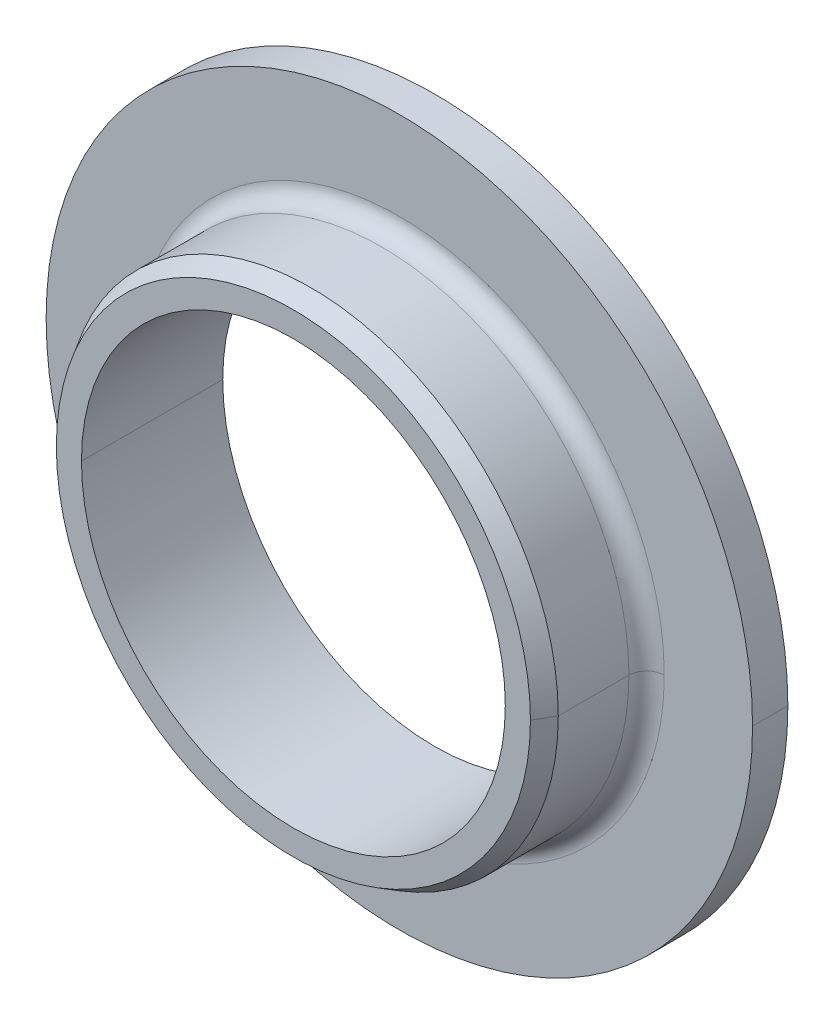
ISO-10303-21;
HEADER;
FILE_DESCRIPTION(('STEP AP214'),'2;1');
FILE_NAME('part.step','',(''),(''),'','','');
FILE_SCHEMA(('AUTOMOTIVE_DESIGN { 1 0 10303 214 1 1 1 1 }'));
ENDSEC;
DATA;
#1=APPLICATION_CONTEXT('core data for automotive mechanical design processes');
#2=APPLICATION_PROTOCOL_DEFINITION('international standard','automotive_design',2000,#1);
#3=PRODUCT_CONTEXT('',#1,'mechanical');
#4=PRODUCT('Part','Part','',(#3));
#5=PRODUCT_RELATED_PRODUCT_CATEGORY('part','',(#4));
#6=PRODUCT_DEFINITION_FORMATION('','',#4);
#7=PRODUCT_DEFINITION_CONTEXT('part definition',#1,'design');
#8=PRODUCT_DEFINITION('design','',#6,#7);
#9=PRODUCT_DEFINITION_SHAPE('','',#8);
#10=(LENGTH_UNIT() NAMED_UNIT(*) SI_UNIT(.MILLI.,.METRE.));
#11=(NAMED_UNIT(*) PLANE_ANGLE_UNIT() SI_UNIT($,.RADIAN.));
#12=(NAMED_UNIT(*) SI_UNIT($,.STERADIAN.) SOLID_ANGLE_UNIT());
#13=UNCERTAINTY_MEASURE_WITH_UNIT(LENGTH_MEASURE(1.E-05),#10,'distance_accuracy_value','');
#14=(GEOMETRIC_REPRESENTATION_CONTEXT(3) GLOBAL_UNCERTAINTY_ASSIGNED_CONTEXT((#13)) GLOBAL_UNIT_ASSIGNED_CONTEXT((#10,
#11,#12)) REPRESENTATION_CONTEXT('',''));
#15=CARTESIAN_POINT('',(0.,0.,0.));
#16=DIRECTION('',(0.,0.,1.));
#17=DIRECTION('',(1.,0.,0.));
#18=AXIS2_PLACEMENT_3D('',#15,#16,#17);
#19=CARTESIAN_POINT('',(8.,0.,0.));
#20=DIRECTION('',(0.,0.,-1.));
#21=DIRECTION('',(0.,-1.,0.));
#22=AXIS2_PLACEMENT_3D('',#19,#20,#21);
#23=PLANE('',#22);
#24=CARTESIAN_POINT('',(0.,0.,0.));
#25=DIRECTION('',(0.,0.,1.));
#26=DIRECTION('',(1.,0.,0.));
#27=AXIS2_PLACEMENT_3D('',#24,#25,#26);
#28=CIRCLE('',#27,6.);
#29=CARTESIAN_POINT('',(6.,0.,0.));
#30=VERTEX_POINT('',#29);
#31=CARTESIAN_POINT('',(-6.,0.,0.));
#32=VERTEX_POINT('',#31);
#33=EDGE_CURVE('E10',#30,#32,#28,.T.);
#34=ORIENTED_EDGE('',*,*,#33,.T.);
#35=CARTESIAN_POINT('',(0.,0.,0.));
#36=DIRECTION('',(0.,0.,1.));
#37=DIRECTION('',(1.,0.,0.));
#38=AXIS2_PLACEMENT_3D('',#35,#36,#37);
#39=CIRCLE('',#38,6.);
#40=EDGE_CURVE('E147',#32,#30,#39,.T.);
#41=ORIENTED_EDGE('',*,*,#40,.T.);
#42=EDGE_LOOP('',(#34,#41));
#43=FACE_BOUND('',#42,.T.);
#44=CARTESIAN_POINT('',(0.,0.,0.));
#45=DIRECTION('',(0.,0.,1.));
#46=DIRECTION('',(1.,0.,0.));
#47=AXIS2_PLACEMENT_3D('',#44,#45,#46);
#48=CIRCLE('',#47,10.);
#49=CARTESIAN_POINT('',(10.,0.,0.));
#50=VERTEX_POINT('',#49);
#51=CARTESIAN_POINT('',(-10.,0.,0.));
#52=VERTEX_POINT('',#51);
#53=EDGE_CURVE('E178',#50,#52,#48,.T.);
#54=ORIENTED_EDGE('',*,*,#53,.F.);
#55=CARTESIAN_POINT('',(0.,0.,0.));
#56=DIRECTION('',(0.,0.,1.));
#57=DIRECTION('',(1.,0.,0.));
#58=AXIS2_PLACEMENT_3D('',#55,#56,#57);
#59=CIRCLE('',#58,10.);
#60=EDGE_CURVE('E117',#52,#50,#59,.T.);
#61=ORIENTED_EDGE('',*,*,#60,.F.);
#62=EDGE_LOOP('',(#54,#61));
#63=FACE_BOUND('',#62,.T.);
#64=ADVANCED_FACE('F16',(#43,#63),#23,.T.);
#65=CARTESIAN_POINT('',(0.,0.,2.));
#66=DIRECTION('',(0.,0.,1.));
#67=DIRECTION('',(1.,0.,0.));
#68=AXIS2_PLACEMENT_3D('',#65,#66,#67);
#69=CYLINDRICAL_SURFACE('',#68,6.);
#70=DIRECTION('',(0.,0.,1.));
#71=VECTOR('',#70,1.);
#72=CARTESIAN_POINT('',(6.,0.,2.));
#73=LINE('',#72,#71);
#74=CARTESIAN_POINT('',(6.,0.,4.));
#75=VERTEX_POINT('',#74);
#76=EDGE_CURVE('E169',#30,#75,#73,.T.);
#77=ORIENTED_EDGE('',*,*,#76,.T.);
#78=CARTESIAN_POINT('',(0.,0.,4.));
#79=DIRECTION('',(0.,0.,1.));
#80=DIRECTION('',(1.,0.,0.));
#81=AXIS2_PLACEMENT_3D('',#78,#79,#80);
#82=CIRCLE('',#81,6.);
#83=CARTESIAN_POINT('',(-6.,0.,4.));
#84=VERTEX_POINT('',#83);
#85=EDGE_CURVE('E27',#75,#84,#82,.T.);
#86=ORIENTED_EDGE('',*,*,#85,.T.);
#87=DIRECTION('',(0.,0.,-1.));
#88=VECTOR('',#87,1.);
#89=CARTESIAN_POINT('',(-6.,0.,2.));
#90=LINE('',#89,#88);
#91=EDGE_CURVE('E145',#84,#32,#90,.T.);
#92=ORIENTED_EDGE('',*,*,#91,.T.);
#93=ORIENTED_EDGE('',*,*,#33,.F.);
#94=EDGE_LOOP('',(#77,#86,#92,#93));
#95=FACE_BOUND('',#94,.T.);
#96=ADVANCED_FACE('F210',(#95),#69,.F.);
#97=CARTESIAN_POINT('',(6.3556624327,0.,4.));
#98=DIRECTION('',(0.,0.,1.));
#99=DIRECTION('',(1.,0.,0.));
#100=AXIS2_PLACEMENT_3D('',#97,#98,#99);
#101=PLANE('',#100);
#102=ORIENTED_EDGE('',*,*,#85,.F.);
#103=CARTESIAN_POINT('',(0.,0.,4.));
#104=DIRECTION('',(0.,0.,1.));
#105=DIRECTION('',(1.,0.,0.));
#106=AXIS2_PLACEMENT_3D('',#103,#104,#105);
#107=CIRCLE('',#106,6.);
#108=EDGE_CURVE('E143',#84,#75,#107,.T.);
#109=ORIENTED_EDGE('',*,*,#108,.F.);
#110=EDGE_LOOP('',(#102,#109));
#111=FACE_BOUND('',#110,.T.);
#112=CARTESIAN_POINT('',(0.,0.,4.));
#113=DIRECTION('',(0.,0.,1.));
#114=DIRECTION('',(1.,0.,0.));
#115=AXIS2_PLACEMENT_3D('',#112,#113,#114);
#116=CIRCLE('',#115,6.7113248654);
#117=CARTESIAN_POINT('',(6.7113248654,0.,4.));
#118=VERTEX_POINT('',#117);
#119=CARTESIAN_POINT('',(-6.7113248654,0.,4.));
#120=VERTEX_POINT('',#119);
#121=EDGE_CURVE('E157',#118,#120,#116,.T.);
#122=ORIENTED_EDGE('',*,*,#121,.T.);
#123=CARTESIAN_POINT('',(0.,0.,4.));
#124=DIRECTION('',(0.,0.,1.));
#125=DIRECTION('',(1.,0.,0.));
#126=AXIS2_PLACEMENT_3D('',#123,#124,#125);
#127=CIRCLE('',#126,6.7113248654);
#128=EDGE_CURVE('E20',#120,#118,#127,.T.);
#129=ORIENTED_EDGE('',*,*,#128,.T.);
#130=EDGE_LOOP('',(#122,#129));
#131=FACE_BOUND('',#130,.T.);
#132=ADVANCED_FACE('F235',(#111,#131),#101,.T.);
#133=CARTESIAN_POINT('',(0.,0.,3.75));
#134=DIRECTION('',(0.,0.,-1.));
#135=DIRECTION('',(1.,0.,0.));
#136=AXIS2_PLACEMENT_3D('',#133,#134,#135);
#137=CONICAL_SURFACE('',#136,6.8556624327,0.52359877560608);
#138=DIRECTION('',(-0.500000000006738,0.,0.866025403780548));
#139=VECTOR('',#138,1.);
#140=CARTESIAN_POINT('',(6.8556624327,0.,3.75));
#141=LINE('',#140,#139);
#142=CARTESIAN_POINT('',(7.,0.,3.5));
#143=VERTEX_POINT('',#142);
#144=EDGE_CURVE('E156',#143,#118,#141,.T.);
#145=ORIENTED_EDGE('',*,*,#144,.T.);
#146=ORIENTED_EDGE('',*,*,#128,.F.);
#147=DIRECTION('',(-0.500000000006738,0.,-0.866025403780548));
#148=VECTOR('',#147,1.);
#149=CARTESIAN_POINT('',(-6.8556624327,0.,3.75));
#150=LINE('',#149,#148);
#151=CARTESIAN_POINT('',(-7.,0.,3.5));
#152=VERTEX_POINT('',#151);
#153=EDGE_CURVE('E155',#120,#152,#150,.T.);
#154=ORIENTED_EDGE('',*,*,#153,.T.);
#155=CARTESIAN_POINT('',(0.,0.,3.5));
#156=DIRECTION('',(0.,0.,1.));
#157=DIRECTION('',(1.,0.,0.));
#158=AXIS2_PLACEMENT_3D('',#155,#156,#157);
#159=CIRCLE('',#158,7.);
#160=EDGE_CURVE('E116',#152,#143,#159,.T.);
#161=ORIENTED_EDGE('',*,*,#160,.T.);
#162=EDGE_LOOP('',(#145,#146,#154,#161));
#163=FACE_BOUND('',#162,.T.);
#164=ADVANCED_FACE('F244',(#163),#137,.T.);
#165=CARTESIAN_POINT('',(0.,0.,2.5));
#166=DIRECTION('',(0.,0.,1.));
#167=DIRECTION('',(1.,0.,0.));
#168=AXIS2_PLACEMENT_3D('',#165,#166,#167);
#169=CYLINDRICAL_SURFACE('',#168,7.);
#170=DIRECTION('',(0.,0.,1.));
#171=VECTOR('',#170,1.);
#172=CARTESIAN_POINT('',(7.,0.,2.5));
#173=LINE('',#172,#171);
#174=CARTESIAN_POINT('',(7.,0.,1.5));
#175=VERTEX_POINT('',#174);
#176=EDGE_CURVE('E161',#175,#143,#173,.T.);
#177=ORIENTED_EDGE('',*,*,#176,.T.);
#178=ORIENTED_EDGE('',*,*,#160,.F.);
#179=DIRECTION('',(0.,0.,-1.));
#180=VECTOR('',#179,1.);
#181=CARTESIAN_POINT('',(-7.,0.,2.5));
#182=LINE('',#181,#180);
#183=CARTESIAN_POINT('',(-7.,0.,1.5));
#184=VERTEX_POINT('',#183);
#185=EDGE_CURVE('E139',#152,#184,#182,.T.);
#186=ORIENTED_EDGE('',*,*,#185,.T.);
#187=CARTESIAN_POINT('',(0.,0.,1.5));
#188=DIRECTION('',(0.,0.,1.));
#189=DIRECTION('',(1.,0.,0.));
#190=AXIS2_PLACEMENT_3D('',#187,#188,#189);
#191=CIRCLE('',#190,7.);
#192=EDGE_CURVE('E129',#184,#175,#191,.T.);
#193=ORIENTED_EDGE('',*,*,#192,.T.);
#194=EDGE_LOOP('',(#177,#178,#186,#193));
#195=FACE_BOUND('',#194,.T.);
#196=ADVANCED_FACE('F232',(#195),#169,.T.);
#197=CARTESIAN_POINT('',(0.,0.,1.5));
#198=DIRECTION('',(0.,0.,1.));
#199=DIRECTION('',(1.,0.,0.));
#200=AXIS2_PLACEMENT_3D('',#197,#198,#199);
#201=TOROIDAL_SURFACE('',#200,7.5,0.5);
#202=CARTESIAN_POINT('',(-7.5,0.,1.5));
#203=DIRECTION('',(0.,-1.,0.));
#204=DIRECTION('',(-1.,0.,0.));
#205=AXIS2_PLACEMENT_3D('',#202,#203,#204);
#206=CIRCLE('',#205,0.5);
#207=CARTESIAN_POINT('',(-7.5,0.,1.));
#208=VERTEX_POINT('',#207);
#209=EDGE_CURVE('E132',#208,#184,#206,.T.);
#210=ORIENTED_EDGE('',*,*,#209,.T.);
#211=CARTESIAN_POINT('',(0.,0.,1.5));
#212=DIRECTION('',(0.,0.,1.));
#213=DIRECTION('',(1.,0.,0.));
#214=AXIS2_PLACEMENT_3D('',#211,#212,#213);
#215=CIRCLE('',#214,7.);
#216=EDGE_CURVE('E124',#175,#184,#215,.T.);
#217=ORIENTED_EDGE('',*,*,#216,.F.);
#218=CARTESIAN_POINT('',(7.5,0.,1.5));
#219=DIRECTION('',(0.,-1.,0.));
#220=DIRECTION('',(1.,0.,0.));
#221=AXIS2_PLACEMENT_3D('',#218,#219,#220);
#222=CIRCLE('',#221,0.5);
#223=CARTESIAN_POINT('',(7.5,0.,1.));
#224=VERTEX_POINT('',#223);
#225=EDGE_CURVE('E121',#175,#224,#222,.T.);
#226=ORIENTED_EDGE('',*,*,#225,.T.);
#227=CARTESIAN_POINT('',(0.,0.,1.));
#228=DIRECTION('',(0.,0.,1.));
#229=DIRECTION('',(1.,0.,0.));
#230=AXIS2_PLACEMENT_3D('',#227,#228,#229);
#231=CIRCLE('',#230,7.5);
#232=EDGE_CURVE('E106',#224,#208,#231,.T.);
#233=ORIENTED_EDGE('',*,*,#232,.T.);
#234=EDGE_LOOP('',(#210,#217,#226,#233));
#235=FACE_BOUND('',#234,.T.);
#236=ADVANCED_FACE('F122',(#235),#201,.F.);
#237=CARTESIAN_POINT('',(8.75,0.,1.));
#238=DIRECTION('',(0.,0.,1.));
#239=DIRECTION('',(1.,0.,0.));
#240=AXIS2_PLACEMENT_3D('',#237,#238,#239);
#241=PLANE('',#240);
#242=ORIENTED_EDGE('',*,*,#232,.F.);
#243=CARTESIAN_POINT('',(0.,0.,1.));
#244=DIRECTION('',(0.,0.,1.));
#245=DIRECTION('',(1.,0.,0.));
#246=AXIS2_PLACEMENT_3D('',#243,#244,#245);
#247=CIRCLE('',#246,7.5);
#248=EDGE_CURVE('E111',#208,#224,#247,.T.);
#249=ORIENTED_EDGE('',*,*,#248,.F.);
#250=EDGE_LOOP('',(#242,#249));
#251=FACE_BOUND('',#250,.T.);
#252=CARTESIAN_POINT('',(0.,0.,1.));
#253=DIRECTION('',(0.,0.,1.));
#254=DIRECTION('',(1.,0.,0.));
#255=AXIS2_PLACEMENT_3D('',#252,#253,#254);
#256=CIRCLE('',#255,10.);
#257=CARTESIAN_POINT('',(10.,0.,1.));
#258=VERTEX_POINT('',#257);
#259=CARTESIAN_POINT('',(-10.,0.,1.));
#260=VERTEX_POINT('',#259);
#261=EDGE_CURVE('E183',#258,#260,#256,.T.);
#262=ORIENTED_EDGE('',*,*,#261,.T.);
#263=CARTESIAN_POINT('',(0.,0.,1.));
#264=DIRECTION('',(0.,0.,1.));
#265=DIRECTION('',(1.,0.,0.));
#266=AXIS2_PLACEMENT_3D('',#263,#264,#265);
#267=CIRCLE('',#266,10.);
#268=EDGE_CURVE('E41',#260,#258,#267,.T.);
#269=ORIENTED_EDGE('',*,*,#268,.T.);
#270=EDGE_LOOP('',(#262,#269));
#271=FACE_BOUND('',#270,.T.);
#272=ADVANCED_FACE('F108',(#251,#271),#241,.T.);
#273=CARTESIAN_POINT('',(0.,0.,0.5));
#274=DIRECTION('',(0.,0.,1.));
#275=DIRECTION('',(1.,0.,0.));
#276=AXIS2_PLACEMENT_3D('',#273,#274,#275);
#277=CYLINDRICAL_SURFACE('',#276,10.);
#278=DIRECTION('',(0.,0.,1.));
#279=VECTOR('',#278,1.);
#280=CARTESIAN_POINT('',(10.,0.,0.5));
#281=LINE('',#280,#279);
#282=EDGE_CURVE('E149',#50,#258,#281,.T.);
#283=ORIENTED_EDGE('',*,*,#282,.T.);
#284=ORIENTED_EDGE('',*,*,#268,.F.);
#285=DIRECTION('',(0.,0.,-1.));
#286=VECTOR('',#285,1.);
#287=CARTESIAN_POINT('',(-10.,0.,0.5));
#288=LINE('',#287,#286);
#289=EDGE_CURVE('E182',#260,#52,#288,.T.);
#290=ORIENTED_EDGE('',*,*,#289,.T.);
#291=ORIENTED_EDGE('',*,*,#60,.T.);
#292=EDGE_LOOP('',(#283,#284,#290,#291));
#293=FACE_BOUND('',#292,.T.);
#294=ADVANCED_FACE('F220',(#293),#277,.T.);
#295=CARTESIAN_POINT('',(0.,0.,0.5));
#296=DIRECTION('',(0.,0.,1.));
#297=DIRECTION('',(1.,0.,0.));
#298=AXIS2_PLACEMENT_3D('',#295,#296,#297);
#299=CYLINDRICAL_SURFACE('',#298,10.);
#300=ORIENTED_EDGE('',*,*,#282,.F.);
#301=ORIENTED_EDGE('',*,*,#53,.T.);
#302=ORIENTED_EDGE('',*,*,#289,.F.);
#303=ORIENTED_EDGE('',*,*,#261,.F.);
#304=EDGE_LOOP('',(#300,#301,#302,#303));
#305=FACE_BOUND('',#304,.T.);
#306=ADVANCED_FACE('F219',(#305),#299,.T.);
#307=CARTESIAN_POINT('',(0.,0.,1.5));
#308=DIRECTION('',(0.,0.,1.));
#309=DIRECTION('',(1.,0.,0.));
#310=AXIS2_PLACEMENT_3D('',#307,#308,#309);
#311=TOROIDAL_SURFACE('',#310,7.5,0.5);
#312=ORIENTED_EDGE('',*,*,#209,.F.);
#313=ORIENTED_EDGE('',*,*,#248,.T.);
#314=ORIENTED_EDGE('',*,*,#225,.F.);
#315=ORIENTED_EDGE('',*,*,#192,.F.);
#316=EDGE_LOOP('',(#312,#313,#314,#315));
#317=FACE_BOUND('',#316,.T.);
#318=ADVANCED_FACE('F131',(#317),#311,.F.);
#319=CARTESIAN_POINT('',(0.,0.,2.5));
#320=DIRECTION('',(0.,0.,1.));
#321=DIRECTION('',(1.,0.,0.));
#322=AXIS2_PLACEMENT_3D('',#319,#320,#321);
#323=CYLINDRICAL_SURFACE('',#322,7.);
#324=ORIENTED_EDGE('',*,*,#176,.F.);
#325=ORIENTED_EDGE('',*,*,#216,.T.);
#326=ORIENTED_EDGE('',*,*,#185,.F.);
#327=CARTESIAN_POINT('',(0.,0.,3.5));
#328=DIRECTION('',(0.,0.,1.));
#329=DIRECTION('',(1.,0.,0.));
#330=AXIS2_PLACEMENT_3D('',#327,#328,#329);
#331=CIRCLE('',#330,7.);
#332=EDGE_CURVE('E151',#143,#152,#331,.T.);
#333=ORIENTED_EDGE('',*,*,#332,.F.);
#334=EDGE_LOOP('',(#324,#325,#326,#333));
#335=FACE_BOUND('',#334,.T.);
#336=ADVANCED_FACE('F238',(#335),#323,.T.);
#337=CARTESIAN_POINT('',(0.,0.,3.75));
#338=DIRECTION('',(0.,0.,-1.));
#339=DIRECTION('',(1.,0.,0.));
#340=AXIS2_PLACEMENT_3D('',#337,#338,#339);
#341=CONICAL_SURFACE('',#340,6.8556624327,0.52359877560608);
#342=ORIENTED_EDGE('',*,*,#144,.F.);
#343=ORIENTED_EDGE('',*,*,#332,.T.);
#344=ORIENTED_EDGE('',*,*,#153,.F.);
#345=ORIENTED_EDGE('',*,*,#121,.F.);
#346=EDGE_LOOP('',(#342,#343,#344,#345));
#347=FACE_BOUND('',#346,.T.);
#348=ADVANCED_FACE('F18',(#347),#341,.T.);
#349=CARTESIAN_POINT('',(0.,0.,2.));
#350=DIRECTION('',(0.,0.,1.));
#351=DIRECTION('',(1.,0.,0.));
#352=AXIS2_PLACEMENT_3D('',#349,#350,#351);
#353=CYLINDRICAL_SURFACE('',#352,6.);
#354=ORIENTED_EDGE('',*,*,#76,.F.);
#355=ORIENTED_EDGE('',*,*,#40,.F.);
#356=ORIENTED_EDGE('',*,*,#91,.F.);
#357=ORIENTED_EDGE('',*,*,#108,.T.);
#358=EDGE_LOOP('',(#354,#355,#356,#357));
#359=FACE_BOUND('',#358,.T.);
#360=ADVANCED_FACE('F207',(#359),#353,.F.);
#361=CLOSED_SHELL('',(#64,#96,#132,#164,#196,#236,#272,#294,#306,#318,#336,#348,#360));
#362=MANIFOLD_SOLID_BREP('B1',#361);
#363=ADVANCED_BREP_SHAPE_REPRESENTATION('',(#18,#362),#14);
#364=SHAPE_DEFINITION_REPRESENTATION(#9,#363);
ENDSEC;
END-ISO-10303-21;
